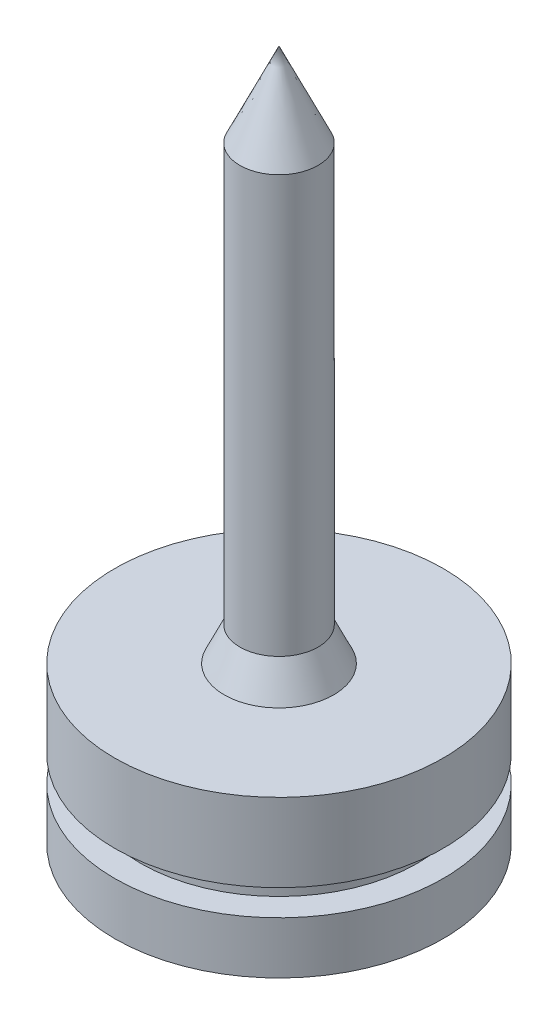
ISO-10303-21;
HEADER;
FILE_DESCRIPTION(('STEP AP214'),'2;1');
FILE_NAME('part.step','',(''),(''),'','','');
FILE_SCHEMA(('AUTOMOTIVE_DESIGN { 1 0 10303 214 1 1 1 1 }'));
ENDSEC;
DATA;
#1=APPLICATION_CONTEXT('core data for automotive mechanical design processes');
#2=APPLICATION_PROTOCOL_DEFINITION('international standard','automotive_design',2000,#1);
#3=PRODUCT_CONTEXT('',#1,'mechanical');
#4=PRODUCT('Part','Part','',(#3));
#5=PRODUCT_RELATED_PRODUCT_CATEGORY('part','',(#4));
#6=PRODUCT_DEFINITION_FORMATION('','',#4);
#7=PRODUCT_DEFINITION_CONTEXT('part definition',#1,'design');
#8=PRODUCT_DEFINITION('design','',#6,#7);
#9=PRODUCT_DEFINITION_SHAPE('','',#8);
#10=(LENGTH_UNIT() NAMED_UNIT(*) SI_UNIT(.MILLI.,.METRE.));
#11=(NAMED_UNIT(*) PLANE_ANGLE_UNIT() SI_UNIT($,.RADIAN.));
#12=(NAMED_UNIT(*) SI_UNIT($,.STERADIAN.) SOLID_ANGLE_UNIT());
#13=UNCERTAINTY_MEASURE_WITH_UNIT(LENGTH_MEASURE(1.E-05),#10,'distance_accuracy_value','');
#14=(GEOMETRIC_REPRESENTATION_CONTEXT(3) GLOBAL_UNCERTAINTY_ASSIGNED_CONTEXT((#13)) GLOBAL_UNIT_ASSIGNED_CONTEXT((#10,
#11,#12)) REPRESENTATION_CONTEXT('',''));
#15=CARTESIAN_POINT('',(0.,0.,0.));
#16=DIRECTION('',(0.,0.,1.));
#17=DIRECTION('',(1.,0.,0.));
#18=AXIS2_PLACEMENT_3D('',#15,#16,#17);
#19=CARTESIAN_POINT('',(0.,0.,0.));
#20=DIRECTION('',(0.,-1.,0.));
#21=DIRECTION('',(0.,0.,-1.));
#22=AXIS2_PLACEMENT_3D('',#19,#20,#21);
#23=PLANE('',#22);
#24=CARTESIAN_POINT('',(0.,0.,0.));
#25=DIRECTION('',(0.,1.,0.));
#26=DIRECTION('',(0.,0.,1.));
#27=AXIS2_PLACEMENT_3D('',#24,#25,#26);
#28=CIRCLE('',#27,31.5);
#29=CARTESIAN_POINT('',(0.,0.,31.5));
#30=VERTEX_POINT('',#29);
#31=EDGE_CURVE('E11',#30,#30,#28,.T.);
#32=ORIENTED_EDGE('',*,*,#31,.F.);
#33=EDGE_LOOP('',(#32));
#34=FACE_BOUND('',#33,.T.);
#35=ADVANCED_FACE('F39',(#34),#23,.T.);
#36=CARTESIAN_POINT('',(0.,132.51732266535,0.));
#37=DIRECTION('',(0.,1.,0.));
#38=DIRECTION('',(0.,0.,1.));
#39=AXIS2_PLACEMENT_3D('',#36,#37,#38);
#40=CYLINDRICAL_SURFACE('',#39,31.5);
#41=ORIENTED_EDGE('',*,*,#31,.T.);
#42=EDGE_LOOP('',(#41));
#43=FACE_BOUND('',#42,.T.);
#44=CARTESIAN_POINT('',(0.,9.99999999999999,0.));
#45=DIRECTION('',(0.,1.,0.));
#46=DIRECTION('',(0.,0.,1.));
#47=AXIS2_PLACEMENT_3D('',#44,#45,#46);
#48=CIRCLE('',#47,31.5);
#49=CARTESIAN_POINT('',(0.,9.99999999999999,31.5));
#50=VERTEX_POINT('',#49);
#51=EDGE_CURVE('E46',#50,#50,#48,.T.);
#52=ORIENTED_EDGE('',*,*,#51,.F.);
#53=EDGE_LOOP('',(#52));
#54=FACE_BOUND('',#53,.T.);
#55=ADVANCED_FACE('F62',(#43,#54),#40,.T.);
#56=CARTESIAN_POINT('',(0.,10.,31.5));
#57=DIRECTION('',(0.,1.,0.));
#58=DIRECTION('',(0.,0.,1.));
#59=AXIS2_PLACEMENT_3D('',#56,#57,#58);
#60=PLANE('',#59);
#61=ORIENTED_EDGE('',*,*,#51,.T.);
#62=EDGE_LOOP('',(#61));
#63=FACE_BOUND('',#62,.T.);
#64=CARTESIAN_POINT('',(0.,9.99999999999999,0.));
#65=DIRECTION('',(0.,1.,0.));
#66=DIRECTION('',(0.,0.,1.));
#67=AXIS2_PLACEMENT_3D('',#64,#65,#66);
#68=CIRCLE('',#67,26.5);
#69=CARTESIAN_POINT('',(0.,9.99999999999999,26.5));
#70=VERTEX_POINT('',#69);
#71=EDGE_CURVE('E75',#70,#70,#68,.T.);
#72=ORIENTED_EDGE('',*,*,#71,.F.);
#73=EDGE_LOOP('',(#72));
#74=FACE_BOUND('',#73,.T.);
#75=ADVANCED_FACE('F67',(#63,#74),#60,.T.);
#76=CARTESIAN_POINT('',(0.,132.51732266535,0.));
#77=DIRECTION('',(0.,1.,0.));
#78=DIRECTION('',(0.,0.,1.));
#79=AXIS2_PLACEMENT_3D('',#76,#77,#78);
#80=CYLINDRICAL_SURFACE('',#79,26.5);
#81=ORIENTED_EDGE('',*,*,#71,.T.);
#82=EDGE_LOOP('',(#81));
#83=FACE_BOUND('',#82,.T.);
#84=CARTESIAN_POINT('',(0.,15.,0.));
#85=DIRECTION('',(0.,1.,0.));
#86=DIRECTION('',(0.,0.,1.));
#87=AXIS2_PLACEMENT_3D('',#84,#85,#86);
#88=CIRCLE('',#87,26.5);
#89=CARTESIAN_POINT('',(0.,15.,26.5));
#90=VERTEX_POINT('',#89);
#91=EDGE_CURVE('E78',#90,#90,#88,.T.);
#92=ORIENTED_EDGE('',*,*,#91,.F.);
#93=EDGE_LOOP('',(#92));
#94=FACE_BOUND('',#93,.T.);
#95=ADVANCED_FACE('F123',(#83,#94),#80,.T.);
#96=CARTESIAN_POINT('',(0.,15.,26.5));
#97=DIRECTION('',(0.,-1.,0.));
#98=DIRECTION('',(0.,0.,-1.));
#99=AXIS2_PLACEMENT_3D('',#96,#97,#98);
#100=PLANE('',#99);
#101=ORIENTED_EDGE('',*,*,#91,.T.);
#102=EDGE_LOOP('',(#101));
#103=FACE_BOUND('',#102,.T.);
#104=CARTESIAN_POINT('',(0.,15.,0.));
#105=DIRECTION('',(0.,1.,0.));
#106=DIRECTION('',(0.,0.,1.));
#107=AXIS2_PLACEMENT_3D('',#104,#105,#106);
#108=CIRCLE('',#107,31.5);
#109=CARTESIAN_POINT('',(0.,15.,31.5));
#110=VERTEX_POINT('',#109);
#111=EDGE_CURVE('E84',#110,#110,#108,.T.);
#112=ORIENTED_EDGE('',*,*,#111,.F.);
#113=EDGE_LOOP('',(#112));
#114=FACE_BOUND('',#113,.T.);
#115=ADVANCED_FACE('F119',(#103,#114),#100,.T.);
#116=CARTESIAN_POINT('',(0.,132.51732266535,0.));
#117=DIRECTION('',(0.,1.,0.));
#118=DIRECTION('',(0.,0.,1.));
#119=AXIS2_PLACEMENT_3D('',#116,#117,#118);
#120=CYLINDRICAL_SURFACE('',#119,31.5);
#121=ORIENTED_EDGE('',*,*,#111,.T.);
#122=EDGE_LOOP('',(#121));
#123=FACE_BOUND('',#122,.T.);
#124=CARTESIAN_POINT('',(0.,30.,0.));
#125=DIRECTION('',(0.,1.,0.));
#126=DIRECTION('',(0.,0.,1.));
#127=AXIS2_PLACEMENT_3D('',#124,#125,#126);
#128=CIRCLE('',#127,31.5);
#129=CARTESIAN_POINT('',(0.,30.,31.5));
#130=VERTEX_POINT('',#129);
#131=EDGE_CURVE('E88',#130,#130,#128,.T.);
#132=ORIENTED_EDGE('',*,*,#131,.F.);
#133=EDGE_LOOP('',(#132));
#134=FACE_BOUND('',#133,.T.);
#135=ADVANCED_FACE('F113',(#123,#134),#120,.T.);
#136=CARTESIAN_POINT('',(0.,30.,31.5));
#137=DIRECTION('',(0.,1.,0.));
#138=DIRECTION('',(0.,0.,1.));
#139=AXIS2_PLACEMENT_3D('',#136,#137,#138);
#140=PLANE('',#139);
#141=ORIENTED_EDGE('',*,*,#131,.T.);
#142=EDGE_LOOP('',(#141));
#143=FACE_BOUND('',#142,.T.);
#144=CARTESIAN_POINT('',(0.,30.,0.));
#145=DIRECTION('',(0.,1.,0.));
#146=DIRECTION('',(0.,0.,1.));
#147=AXIS2_PLACEMENT_3D('',#144,#145,#146);
#148=CIRCLE('',#147,10.5);
#149=CARTESIAN_POINT('',(0.,30.,10.5));
#150=VERTEX_POINT('',#149);
#151=EDGE_CURVE('E92',#150,#150,#148,.T.);
#152=ORIENTED_EDGE('',*,*,#151,.F.);
#153=EDGE_LOOP('',(#152));
#154=FACE_BOUND('',#153,.T.);
#155=ADVANCED_FACE('F107',(#143,#154),#140,.T.);
#156=CARTESIAN_POINT('',(0.,36.4335207615287,0.));
#157=DIRECTION('',(0.,-1.,0.));
#158=DIRECTION('',(0.,0.,-1.));
#159=AXIS2_PLACEMENT_3D('',#156,#157,#158);
#160=CONICAL_SURFACE('',#159,7.49999999999999,0.43633231299858);
#161=ORIENTED_EDGE('',*,*,#151,.T.);
#162=EDGE_LOOP('',(#161));
#163=FACE_BOUND('',#162,.T.);
#164=CARTESIAN_POINT('',(0.,36.4335207615287,0.));
#165=DIRECTION('',(0.,1.,0.));
#166=DIRECTION('',(0.,0.,1.));
#167=AXIS2_PLACEMENT_3D('',#164,#165,#166);
#168=CIRCLE('',#167,7.49999999999999);
#169=CARTESIAN_POINT('',(0.,36.4335207615287,7.49999999999999));
#170=VERTEX_POINT('',#169);
#171=EDGE_CURVE('E96',#170,#170,#168,.T.);
#172=ORIENTED_EDGE('',*,*,#171,.F.);
#173=EDGE_LOOP('',(#172));
#174=FACE_BOUND('',#173,.T.);
#175=ADVANCED_FACE('F57',(#163,#174),#160,.T.);
#176=CARTESIAN_POINT('',(0.,132.51732266535,0.));
#177=DIRECTION('',(0.,1.,0.));
#178=DIRECTION('',(0.,0.,1.));
#179=AXIS2_PLACEMENT_3D('',#176,#177,#178);
#180=CYLINDRICAL_SURFACE('',#179,7.49999999999999);
#181=ORIENTED_EDGE('',*,*,#171,.T.);
#182=EDGE_LOOP('',(#181));
#183=FACE_BOUND('',#182,.T.);
#184=CARTESIAN_POINT('',(0.,116.433520761529,0.));
#185=DIRECTION('',(0.,1.,0.));
#186=DIRECTION('',(0.,0.,1.));
#187=AXIS2_PLACEMENT_3D('',#184,#185,#186);
#188=CIRCLE('',#187,7.49999999999999);
#189=CARTESIAN_POINT('',(0.,116.433520761529,7.49999999999999));
#190=VERTEX_POINT('',#189);
#191=EDGE_CURVE('E100',#190,#190,#188,.T.);
#192=ORIENTED_EDGE('',*,*,#191,.F.);
#193=EDGE_LOOP('',(#192));
#194=FACE_BOUND('',#193,.T.);
#195=ADVANCED_FACE('F51',(#183,#194),#180,.T.);
#196=CARTESIAN_POINT('',(0.,132.51732266535,0.));
#197=DIRECTION('',(0.,-1.,0.));
#198=DIRECTION('',(0.,0.,-1.));
#199=AXIS2_PLACEMENT_3D('',#196,#197,#198);
#200=CONICAL_SURFACE('',#199,0.,0.43633231299858);
#201=ORIENTED_EDGE('',*,*,#191,.T.);
#202=EDGE_LOOP('',(#201));
#203=FACE_BOUND('',#202,.T.);
#204=CARTESIAN_POINT('',(0.,132.51732266535,0.));
#205=VERTEX_POINT('',#204);
#206=VERTEX_LOOP('',#205);
#207=FACE_BOUND('',#206,.T.);
#208=ADVANCED_FACE('F49',(#203,#207),#200,.T.);
#209=CLOSED_SHELL('',(#35,#55,#75,#95,#115,#135,#155,#175,#195,#208));
#210=MANIFOLD_SOLID_BREP('B2',#209);
#211=ADVANCED_BREP_SHAPE_REPRESENTATION('',(#18,#210),#14);
#212=SHAPE_DEFINITION_REPRESENTATION(#9,#211);
ENDSEC;
END-ISO-10303-21;
